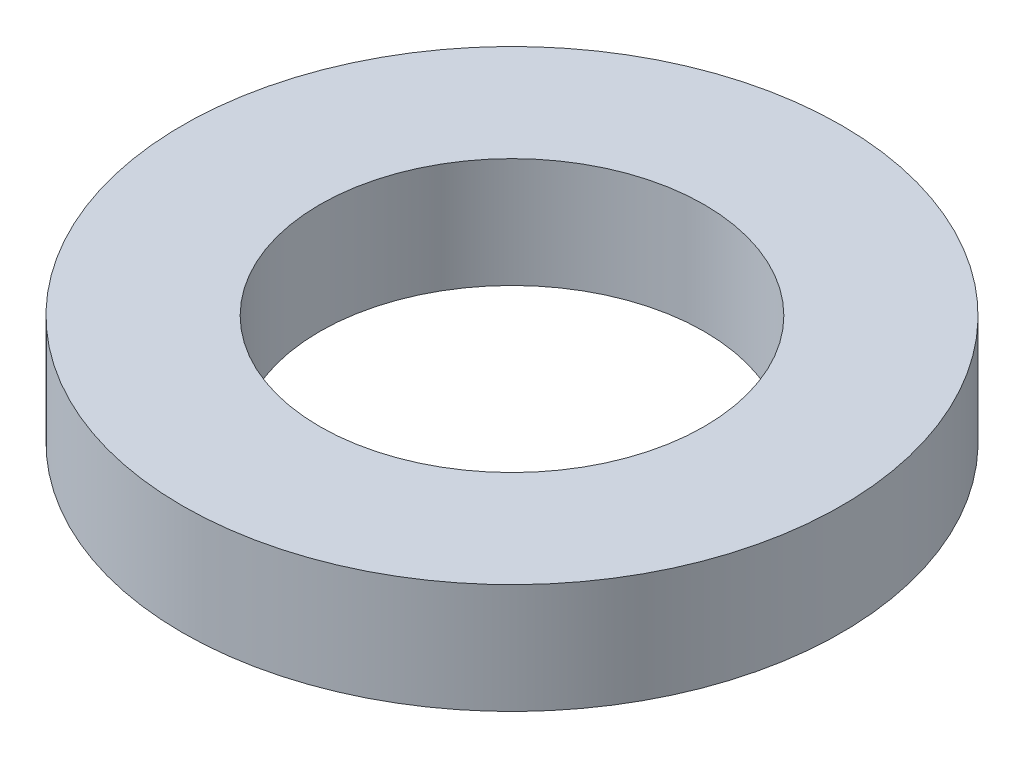
ISO-10303-21;
HEADER;
FILE_DESCRIPTION(('STEP AP214'),'2;1');
FILE_NAME('part.step','',(''),(''),'','','');
FILE_SCHEMA(('AUTOMOTIVE_DESIGN { 1 0 10303 214 1 1 1 1 }'));
ENDSEC;
DATA;
#1=APPLICATION_CONTEXT('core data for automotive mechanical design processes');
#2=APPLICATION_PROTOCOL_DEFINITION('international standard','automotive_design',2000,#1);
#3=PRODUCT_CONTEXT('',#1,'mechanical');
#4=PRODUCT('Part','Part','',(#3));
#5=PRODUCT_RELATED_PRODUCT_CATEGORY('part','',(#4));
#6=PRODUCT_DEFINITION_FORMATION('','',#4);
#7=PRODUCT_DEFINITION_CONTEXT('part definition',#1,'design');
#8=PRODUCT_DEFINITION('design','',#6,#7);
#9=PRODUCT_DEFINITION_SHAPE('','',#8);
#10=(LENGTH_UNIT() NAMED_UNIT(*) SI_UNIT(.MILLI.,.METRE.));
#11=(NAMED_UNIT(*) PLANE_ANGLE_UNIT() SI_UNIT($,.RADIAN.));
#12=(NAMED_UNIT(*) SI_UNIT($,.STERADIAN.) SOLID_ANGLE_UNIT());
#13=UNCERTAINTY_MEASURE_WITH_UNIT(LENGTH_MEASURE(1.E-05),#10,'distance_accuracy_value','');
#14=(GEOMETRIC_REPRESENTATION_CONTEXT(3) GLOBAL_UNCERTAINTY_ASSIGNED_CONTEXT((#13)) GLOBAL_UNIT_ASSIGNED_CONTEXT((#10,
#11,#12)) REPRESENTATION_CONTEXT('',''));
#15=CARTESIAN_POINT('',(0.,0.,0.));
#16=DIRECTION('',(0.,0.,1.));
#17=DIRECTION('',(1.,0.,0.));
#18=AXIS2_PLACEMENT_3D('',#15,#16,#17);
#19=CARTESIAN_POINT('',(0.,20.,0.));
#20=DIRECTION('',(0.,-1.,0.));
#21=DIRECTION('',(0.,0.,-1.));
#22=AXIS2_PLACEMENT_3D('',#19,#20,#21);
#23=CYLINDRICAL_SURFACE('',#22,60.);
#24=CARTESIAN_POINT('',(0.,20.,0.));
#25=DIRECTION('',(0.,1.,0.));
#26=DIRECTION('',(0.,0.,1.));
#27=AXIS2_PLACEMENT_3D('',#24,#25,#26);
#28=CIRCLE('',#27,60.);
#29=CARTESIAN_POINT('',(0.,20.,60.));
#30=VERTEX_POINT('',#29);
#31=EDGE_CURVE('E10',#30,#30,#28,.T.);
#32=ORIENTED_EDGE('',*,*,#31,.F.);
#33=EDGE_LOOP('',(#32));
#34=FACE_BOUND('',#33,.T.);
#35=CARTESIAN_POINT('',(0.,0.,0.));
#36=DIRECTION('',(0.,1.,0.));
#37=DIRECTION('',(0.,0.,1.));
#38=AXIS2_PLACEMENT_3D('',#35,#36,#37);
#39=CIRCLE('',#38,60.);
#40=CARTESIAN_POINT('',(0.,0.,60.));
#41=VERTEX_POINT('',#40);
#42=EDGE_CURVE('E37',#41,#41,#39,.T.);
#43=ORIENTED_EDGE('',*,*,#42,.T.);
#44=EDGE_LOOP('',(#43));
#45=FACE_BOUND('',#44,.T.);
#46=ADVANCED_FACE('F40',(#34,#45),#23,.T.);
#47=CARTESIAN_POINT('',(0.,20.,0.));
#48=DIRECTION('',(0.,1.,0.));
#49=DIRECTION('',(0.,0.,1.));
#50=AXIS2_PLACEMENT_3D('',#47,#48,#49);
#51=PLANE('',#50);
#52=CARTESIAN_POINT('',(0.,20.,0.));
#53=DIRECTION('',(0.,1.,0.));
#54=DIRECTION('',(0.,0.,1.));
#55=AXIS2_PLACEMENT_3D('',#52,#53,#54);
#56=CIRCLE('',#55,35.);
#57=CARTESIAN_POINT('',(0.,20.,35.));
#58=VERTEX_POINT('',#57);
#59=EDGE_CURVE('E50',#58,#58,#56,.T.);
#60=ORIENTED_EDGE('',*,*,#59,.F.);
#61=EDGE_LOOP('',(#60));
#62=FACE_BOUND('',#61,.T.);
#63=ORIENTED_EDGE('',*,*,#31,.T.);
#64=EDGE_LOOP('',(#63));
#65=FACE_BOUND('',#64,.T.);
#66=ADVANCED_FACE('F59',(#62,#65),#51,.T.);
#67=CARTESIAN_POINT('',(0.,0.,0.));
#68=DIRECTION('',(0.,1.,0.));
#69=DIRECTION('',(0.,0.,1.));
#70=AXIS2_PLACEMENT_3D('',#67,#68,#69);
#71=PLANE('',#70);
#72=CARTESIAN_POINT('',(0.,0.,0.));
#73=DIRECTION('',(0.,1.,0.));
#74=DIRECTION('',(0.,0.,1.));
#75=AXIS2_PLACEMENT_3D('',#72,#73,#74);
#76=CIRCLE('',#75,35.);
#77=CARTESIAN_POINT('',(0.,0.,35.));
#78=VERTEX_POINT('',#77);
#79=EDGE_CURVE('E47',#78,#78,#76,.T.);
#80=ORIENTED_EDGE('',*,*,#79,.T.);
#81=EDGE_LOOP('',(#80));
#82=FACE_BOUND('',#81,.T.);
#83=ORIENTED_EDGE('',*,*,#42,.F.);
#84=EDGE_LOOP('',(#83));
#85=FACE_BOUND('',#84,.T.);
#86=ADVANCED_FACE('F58',(#82,#85),#71,.F.);
#87=CARTESIAN_POINT('',(0.,20.,0.));
#88=DIRECTION('',(0.,-1.,0.));
#89=DIRECTION('',(0.,0.,-1.));
#90=AXIS2_PLACEMENT_3D('',#87,#88,#89);
#91=CYLINDRICAL_SURFACE('',#90,35.);
#92=ORIENTED_EDGE('',*,*,#59,.T.);
#93=EDGE_LOOP('',(#92));
#94=FACE_BOUND('',#93,.T.);
#95=ORIENTED_EDGE('',*,*,#79,.F.);
#96=EDGE_LOOP('',(#95));
#97=FACE_BOUND('',#96,.T.);
#98=ADVANCED_FACE('F54',(#94,#97),#91,.F.);
#99=CLOSED_SHELL('',(#46,#66,#86,#98));
#100=MANIFOLD_SOLID_BREP('B2',#99);
#101=ADVANCED_BREP_SHAPE_REPRESENTATION('',(#18,#100),#14);
#102=SHAPE_DEFINITION_REPRESENTATION(#9,#101);
ENDSEC;
END-ISO-10303-21;
